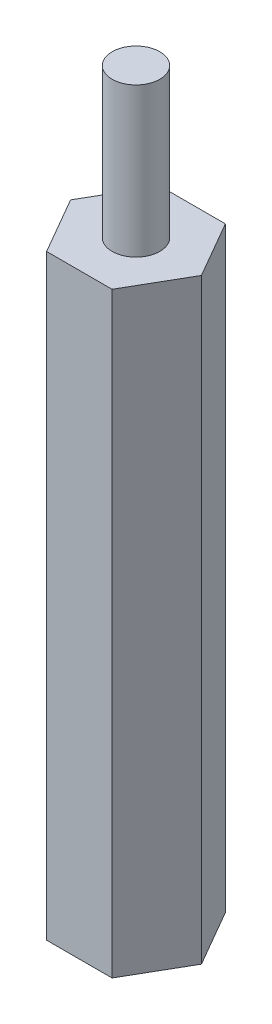
ISO-10303-21;
HEADER;
FILE_DESCRIPTION(('STEP AP214'),'2;1');
FILE_NAME('part.step','',(''),(''),'','','');
FILE_SCHEMA(('AUTOMOTIVE_DESIGN { 1 0 10303 214 1 1 1 1 }'));
ENDSEC;
DATA;
#1=APPLICATION_CONTEXT('core data for automotive mechanical design processes');
#2=APPLICATION_PROTOCOL_DEFINITION('international standard','automotive_design',2000,#1);
#3=PRODUCT_CONTEXT('',#1,'mechanical');
#4=PRODUCT('Part','Part','',(#3));
#5=PRODUCT_RELATED_PRODUCT_CATEGORY('part','',(#4));
#6=PRODUCT_DEFINITION_FORMATION('','',#4);
#7=PRODUCT_DEFINITION_CONTEXT('part definition',#1,'design');
#8=PRODUCT_DEFINITION('design','',#6,#7);
#9=PRODUCT_DEFINITION_SHAPE('','',#8);
#10=(LENGTH_UNIT() NAMED_UNIT(*) SI_UNIT(.MILLI.,.METRE.));
#11=(NAMED_UNIT(*) PLANE_ANGLE_UNIT() SI_UNIT($,.RADIAN.));
#12=(NAMED_UNIT(*) SI_UNIT($,.STERADIAN.) SOLID_ANGLE_UNIT());
#13=UNCERTAINTY_MEASURE_WITH_UNIT(LENGTH_MEASURE(1.E-05),#10,'distance_accuracy_value','');
#14=(GEOMETRIC_REPRESENTATION_CONTEXT(3) GLOBAL_UNCERTAINTY_ASSIGNED_CONTEXT((#13)) GLOBAL_UNIT_ASSIGNED_CONTEXT((#10,
#11,#12)) REPRESENTATION_CONTEXT('',''));
#15=CARTESIAN_POINT('',(0.,0.,0.));
#16=DIRECTION('',(0.,0.,1.));
#17=DIRECTION('',(1.,0.,0.));
#18=AXIS2_PLACEMENT_3D('',#15,#16,#17);
#19=CARTESIAN_POINT('',(-1.39314619955457,25.4,2.413));
#20=DIRECTION('',(0.,0.,-1.));
#21=DIRECTION('',(-1.,0.,0.));
#22=AXIS2_PLACEMENT_3D('',#19,#20,#21);
#23=PLANE('',#22);
#24=DIRECTION('',(1.,0.,0.));
#25=VECTOR('',#24,1.);
#26=CARTESIAN_POINT('',(-1.39314619955457,0.,2.413));
#27=LINE('',#26,#25);
#28=CARTESIAN_POINT('',(-1.39314619955457,0.,2.413));
#29=VERTEX_POINT('',#28);
#30=CARTESIAN_POINT('',(1.39314619955457,0.,2.413));
#31=VERTEX_POINT('',#30);
#32=EDGE_CURVE('E118',#29,#31,#27,.T.);
#33=ORIENTED_EDGE('',*,*,#32,.T.);
#34=DIRECTION('',(0.,-1.,0.));
#35=VECTOR('',#34,1.);
#36=CARTESIAN_POINT('',(1.39314619955457,25.4,2.413));
#37=LINE('',#36,#35);
#38=CARTESIAN_POINT('',(1.39314619955457,25.4,2.413));
#39=VERTEX_POINT('',#38);
#40=EDGE_CURVE('E35',#39,#31,#37,.T.);
#41=ORIENTED_EDGE('',*,*,#40,.F.);
#42=DIRECTION('',(1.,0.,0.));
#43=VECTOR('',#42,1.);
#44=CARTESIAN_POINT('',(-1.39314619955457,25.4,2.413));
#45=LINE('',#44,#43);
#46=CARTESIAN_POINT('',(-1.39314619955457,25.4,2.413));
#47=VERTEX_POINT('',#46);
#48=EDGE_CURVE('E129',#47,#39,#45,.T.);
#49=ORIENTED_EDGE('',*,*,#48,.F.);
#50=DIRECTION('',(0.,-1.,0.));
#51=VECTOR('',#50,1.);
#52=CARTESIAN_POINT('',(-1.39314619955457,25.4,2.413));
#53=LINE('',#52,#51);
#54=EDGE_CURVE('E114',#47,#29,#53,.T.);
#55=ORIENTED_EDGE('',*,*,#54,.T.);
#56=EDGE_LOOP('',(#33,#41,#49,#55));
#57=FACE_BOUND('',#56,.T.);
#58=ADVANCED_FACE('F32',(#57),#23,.F.);
#59=CARTESIAN_POINT('',(1.39314619955457,25.4,2.413));
#60=DIRECTION('',(-0.866025403784438,0.,-0.5));
#61=DIRECTION('',(-0.5,0.,0.866025403784439));
#62=AXIS2_PLACEMENT_3D('',#59,#60,#61);
#63=PLANE('',#62);
#64=DIRECTION('',(0.5,0.,-0.866025403784439));
#65=VECTOR('',#64,1.);
#66=CARTESIAN_POINT('',(1.39314619955457,0.,2.413));
#67=LINE('',#66,#65);
#68=CARTESIAN_POINT('',(2.78629239910913,0.,0.));
#69=VERTEX_POINT('',#68);
#70=EDGE_CURVE('E121',#31,#69,#67,.T.);
#71=ORIENTED_EDGE('',*,*,#70,.T.);
#72=DIRECTION('',(0.,-1.,0.));
#73=VECTOR('',#72,1.);
#74=CARTESIAN_POINT('',(2.78629239910913,25.4,0.));
#75=LINE('',#74,#73);
#76=CARTESIAN_POINT('',(2.78629239910913,25.4,0.));
#77=VERTEX_POINT('',#76);
#78=EDGE_CURVE('E132',#77,#69,#75,.T.);
#79=ORIENTED_EDGE('',*,*,#78,.F.);
#80=DIRECTION('',(0.5,0.,-0.866025403784439));
#81=VECTOR('',#80,1.);
#82=CARTESIAN_POINT('',(1.39314619955457,25.4,2.413));
#83=LINE('',#82,#81);
#84=EDGE_CURVE('E87',#39,#77,#83,.T.);
#85=ORIENTED_EDGE('',*,*,#84,.F.);
#86=ORIENTED_EDGE('',*,*,#40,.T.);
#87=EDGE_LOOP('',(#71,#79,#85,#86));
#88=FACE_BOUND('',#87,.T.);
#89=ADVANCED_FACE('F137',(#88),#63,.F.);
#90=CARTESIAN_POINT('',(2.78629239910913,25.4,0.));
#91=DIRECTION('',(-0.866025403784439,0.,0.5));
#92=DIRECTION('',(0.5,0.,0.866025403784439));
#93=AXIS2_PLACEMENT_3D('',#90,#91,#92);
#94=PLANE('',#93);
#95=DIRECTION('',(-0.5,0.,-0.866025403784439));
#96=VECTOR('',#95,1.);
#97=CARTESIAN_POINT('',(2.78629239910913,0.,0.));
#98=LINE('',#97,#96);
#99=CARTESIAN_POINT('',(1.39314619955457,0.,-2.413));
#100=VERTEX_POINT('',#99);
#101=EDGE_CURVE('E124',#69,#100,#98,.T.);
#102=ORIENTED_EDGE('',*,*,#101,.T.);
#103=DIRECTION('',(0.,-1.,0.));
#104=VECTOR('',#103,1.);
#105=CARTESIAN_POINT('',(1.39314619955457,25.4,-2.413));
#106=LINE('',#105,#104);
#107=CARTESIAN_POINT('',(1.39314619955457,25.4,-2.413));
#108=VERTEX_POINT('',#107);
#109=EDGE_CURVE('E109',#108,#100,#106,.T.);
#110=ORIENTED_EDGE('',*,*,#109,.F.);
#111=DIRECTION('',(-0.5,0.,-0.866025403784439));
#112=VECTOR('',#111,1.);
#113=CARTESIAN_POINT('',(2.78629239910913,25.4,0.));
#114=LINE('',#113,#112);
#115=EDGE_CURVE('E100',#77,#108,#114,.T.);
#116=ORIENTED_EDGE('',*,*,#115,.F.);
#117=ORIENTED_EDGE('',*,*,#78,.T.);
#118=EDGE_LOOP('',(#102,#110,#116,#117));
#119=FACE_BOUND('',#118,.T.);
#120=ADVANCED_FACE('F143',(#119),#94,.F.);
#121=CARTESIAN_POINT('',(1.39314619955457,25.4,-2.413));
#122=DIRECTION('',(0.,0.,1.));
#123=DIRECTION('',(1.,0.,0.));
#124=AXIS2_PLACEMENT_3D('',#121,#122,#123);
#125=PLANE('',#124);
#126=DIRECTION('',(-1.,0.,0.));
#127=VECTOR('',#126,1.);
#128=CARTESIAN_POINT('',(1.39314619955457,0.,-2.413));
#129=LINE('',#128,#127);
#130=CARTESIAN_POINT('',(-1.39314619955457,0.,-2.413));
#131=VERTEX_POINT('',#130);
#132=EDGE_CURVE('E108',#100,#131,#129,.T.);
#133=ORIENTED_EDGE('',*,*,#132,.T.);
#134=DIRECTION('',(0.,-1.,0.));
#135=VECTOR('',#134,1.);
#136=CARTESIAN_POINT('',(-1.39314619955457,25.4,-2.413));
#137=LINE('',#136,#135);
#138=CARTESIAN_POINT('',(-1.39314619955457,25.4,-2.413));
#139=VERTEX_POINT('',#138);
#140=EDGE_CURVE('E105',#139,#131,#137,.T.);
#141=ORIENTED_EDGE('',*,*,#140,.F.);
#142=DIRECTION('',(-1.,0.,0.));
#143=VECTOR('',#142,1.);
#144=CARTESIAN_POINT('',(1.39314619955457,25.4,-2.413));
#145=LINE('',#144,#143);
#146=EDGE_CURVE('E94',#108,#139,#145,.T.);
#147=ORIENTED_EDGE('',*,*,#146,.F.);
#148=ORIENTED_EDGE('',*,*,#109,.T.);
#149=EDGE_LOOP('',(#133,#141,#147,#148));
#150=FACE_BOUND('',#149,.T.);
#151=ADVANCED_FACE('F106',(#150),#125,.F.);
#152=CARTESIAN_POINT('',(-1.39314619955457,25.4,-2.413));
#153=DIRECTION('',(0.866025403784438,0.,0.5));
#154=DIRECTION('',(0.5,0.,-0.866025403784438));
#155=AXIS2_PLACEMENT_3D('',#152,#153,#154);
#156=PLANE('',#155);
#157=DIRECTION('',(-0.5,0.,0.866025403784438));
#158=VECTOR('',#157,1.);
#159=CARTESIAN_POINT('',(-1.39314619955457,0.,-2.413));
#160=LINE('',#159,#158);
#161=CARTESIAN_POINT('',(-2.78629239910913,0.,0.));
#162=VERTEX_POINT('',#161);
#163=EDGE_CURVE('E72',#131,#162,#160,.T.);
#164=ORIENTED_EDGE('',*,*,#163,.T.);
#165=DIRECTION('',(0.,-1.,0.));
#166=VECTOR('',#165,1.);
#167=CARTESIAN_POINT('',(-2.78629239910913,25.4,0.));
#168=LINE('',#167,#166);
#169=CARTESIAN_POINT('',(-2.78629239910913,25.4,0.));
#170=VERTEX_POINT('',#169);
#171=EDGE_CURVE('E110',#170,#162,#168,.T.);
#172=ORIENTED_EDGE('',*,*,#171,.F.);
#173=DIRECTION('',(-0.5,0.,0.866025403784438));
#174=VECTOR('',#173,1.);
#175=CARTESIAN_POINT('',(-1.39314619955457,25.4,-2.413));
#176=LINE('',#175,#174);
#177=EDGE_CURVE('E98',#139,#170,#176,.T.);
#178=ORIENTED_EDGE('',*,*,#177,.F.);
#179=ORIENTED_EDGE('',*,*,#140,.T.);
#180=EDGE_LOOP('',(#164,#172,#178,#179));
#181=FACE_BOUND('',#180,.T.);
#182=ADVANCED_FACE('F112',(#181),#156,.F.);
#183=CARTESIAN_POINT('',(-2.78629239910913,25.4,0.));
#184=DIRECTION('',(0.866025403784439,0.,-0.5));
#185=DIRECTION('',(-0.5,0.,-0.866025403784439));
#186=AXIS2_PLACEMENT_3D('',#183,#184,#185);
#187=PLANE('',#186);
#188=DIRECTION('',(0.5,0.,0.866025403784439));
#189=VECTOR('',#188,1.);
#190=CARTESIAN_POINT('',(-2.78629239910913,0.,0.));
#191=LINE('',#190,#189);
#192=EDGE_CURVE('E78',#162,#29,#191,.T.);
#193=ORIENTED_EDGE('',*,*,#192,.T.);
#194=ORIENTED_EDGE('',*,*,#54,.F.);
#195=DIRECTION('',(0.5,0.,0.866025403784439));
#196=VECTOR('',#195,1.);
#197=CARTESIAN_POINT('',(-2.78629239910913,25.4,0.));
#198=LINE('',#197,#196);
#199=EDGE_CURVE('E49',#170,#47,#198,.T.);
#200=ORIENTED_EDGE('',*,*,#199,.F.);
#201=ORIENTED_EDGE('',*,*,#171,.T.);
#202=EDGE_LOOP('',(#193,#194,#200,#201));
#203=FACE_BOUND('',#202,.T.);
#204=ADVANCED_FACE('F174',(#203),#187,.F.);
#205=CARTESIAN_POINT('',(0.,25.4,0.));
#206=DIRECTION('',(0.,1.,0.));
#207=DIRECTION('',(0.,0.,1.));
#208=AXIS2_PLACEMENT_3D('',#205,#206,#207);
#209=PLANE('',#208);
#210=CARTESIAN_POINT('',(0.,25.4,0.));
#211=DIRECTION('',(0.,1.,0.));
#212=DIRECTION('',(0.,0.,1.));
#213=AXIS2_PLACEMENT_3D('',#210,#211,#212);
#214=CIRCLE('',#213,1.016);
#215=CARTESIAN_POINT('',(0.,25.4,1.016));
#216=VERTEX_POINT('',#215);
#217=EDGE_CURVE('E11',#216,#216,#214,.T.);
#218=ORIENTED_EDGE('',*,*,#217,.F.);
#219=EDGE_LOOP('',(#218));
#220=FACE_BOUND('',#219,.T.);
#221=ORIENTED_EDGE('',*,*,#48,.T.);
#222=ORIENTED_EDGE('',*,*,#84,.T.);
#223=ORIENTED_EDGE('',*,*,#115,.T.);
#224=ORIENTED_EDGE('',*,*,#146,.T.);
#225=ORIENTED_EDGE('',*,*,#177,.T.);
#226=ORIENTED_EDGE('',*,*,#199,.T.);
#227=EDGE_LOOP('',(#221,#222,#223,#224,#225,#226));
#228=FACE_BOUND('',#227,.T.);
#229=ADVANCED_FACE('F96',(#220,#228),#209,.T.);
#230=CARTESIAN_POINT('',(0.,0.,0.));
#231=DIRECTION('',(0.,1.,0.));
#232=DIRECTION('',(0.,0.,1.));
#233=AXIS2_PLACEMENT_3D('',#230,#231,#232);
#234=PLANE('',#233);
#235=CARTESIAN_POINT('',(0.,0.,0.));
#236=DIRECTION('',(0.,-1.,0.));
#237=DIRECTION('',(0.,0.,-1.));
#238=AXIS2_PLACEMENT_3D('',#235,#236,#237);
#239=CIRCLE('',#238,1.016);
#240=CARTESIAN_POINT('',(0.,0.,-1.016));
#241=VERTEX_POINT('',#240);
#242=EDGE_CURVE('E150',#241,#241,#239,.T.);
#243=ORIENTED_EDGE('',*,*,#242,.F.);
#244=EDGE_LOOP('',(#243));
#245=FACE_BOUND('',#244,.T.);
#246=ORIENTED_EDGE('',*,*,#32,.F.);
#247=ORIENTED_EDGE('',*,*,#192,.F.);
#248=ORIENTED_EDGE('',*,*,#163,.F.);
#249=ORIENTED_EDGE('',*,*,#132,.F.);
#250=ORIENTED_EDGE('',*,*,#101,.F.);
#251=ORIENTED_EDGE('',*,*,#70,.F.);
#252=EDGE_LOOP('',(#246,#247,#248,#249,#250,#251));
#253=FACE_BOUND('',#252,.T.);
#254=ADVANCED_FACE('F142',(#245,#253),#234,.F.);
#255=CARTESIAN_POINT('',(0.,31.75,0.));
#256=DIRECTION('',(0.,-1.,0.));
#257=DIRECTION('',(0.,0.,-1.));
#258=AXIS2_PLACEMENT_3D('',#255,#256,#257);
#259=CYLINDRICAL_SURFACE('',#258,1.016);
#260=CARTESIAN_POINT('',(0.,31.75,0.));
#261=DIRECTION('',(0.,1.,0.));
#262=DIRECTION('',(0.,0.,1.));
#263=AXIS2_PLACEMENT_3D('',#260,#261,#262);
#264=CIRCLE('',#263,1.016);
#265=CARTESIAN_POINT('',(0.,31.75,1.016));
#266=VERTEX_POINT('',#265);
#267=EDGE_CURVE('E122',#266,#266,#264,.T.);
#268=ORIENTED_EDGE('',*,*,#267,.F.);
#269=EDGE_LOOP('',(#268));
#270=FACE_BOUND('',#269,.T.);
#271=ORIENTED_EDGE('',*,*,#217,.T.);
#272=EDGE_LOOP('',(#271));
#273=FACE_BOUND('',#272,.T.);
#274=ADVANCED_FACE('F166',(#270,#273),#259,.T.);
#275=CARTESIAN_POINT('',(0.,31.75,0.));
#276=DIRECTION('',(0.,1.,0.));
#277=DIRECTION('',(0.,0.,1.));
#278=AXIS2_PLACEMENT_3D('',#275,#276,#277);
#279=PLANE('',#278);
#280=ORIENTED_EDGE('',*,*,#267,.T.);
#281=EDGE_LOOP('',(#280));
#282=FACE_BOUND('',#281,.T.);
#283=ADVANCED_FACE('F161',(#282),#279,.T.);
#284=CARTESIAN_POINT('',(0.,6.35,0.));
#285=DIRECTION('',(0.,-1.,0.));
#286=DIRECTION('',(0.,0.,-1.));
#287=AXIS2_PLACEMENT_3D('',#284,#285,#286);
#288=CYLINDRICAL_SURFACE('',#287,1.016);
#289=CARTESIAN_POINT('',(0.,6.35,0.));
#290=DIRECTION('',(0.,-1.,0.));
#291=DIRECTION('',(0.,0.,-1.));
#292=AXIS2_PLACEMENT_3D('',#289,#290,#291);
#293=CIRCLE('',#292,1.016);
#294=CARTESIAN_POINT('',(0.,6.35,-1.016));
#295=VERTEX_POINT('',#294);
#296=EDGE_CURVE('E149',#295,#295,#293,.T.);
#297=ORIENTED_EDGE('',*,*,#296,.F.);
#298=EDGE_LOOP('',(#297));
#299=FACE_BOUND('',#298,.T.);
#300=ORIENTED_EDGE('',*,*,#242,.T.);
#301=EDGE_LOOP('',(#300));
#302=FACE_BOUND('',#301,.T.);
#303=ADVANCED_FACE('F158',(#299,#302),#288,.F.);
#304=CARTESIAN_POINT('',(0.,6.35,0.));
#305=DIRECTION('',(0.,-1.,0.));
#306=DIRECTION('',(0.,0.,-1.));
#307=AXIS2_PLACEMENT_3D('',#304,#305,#306);
#308=PLANE('',#307);
#309=ORIENTED_EDGE('',*,*,#296,.T.);
#310=EDGE_LOOP('',(#309));
#311=FACE_BOUND('',#310,.T.);
#312=ADVANCED_FACE('F156',(#311),#308,.T.);
#313=CLOSED_SHELL('',(#58,#89,#120,#151,#182,#204,#229,#254,#274,#283,#303,#312));
#314=MANIFOLD_SOLID_BREP('B2',#313);
#315=ADVANCED_BREP_SHAPE_REPRESENTATION('',(#18,#314),#14);
#316=SHAPE_DEFINITION_REPRESENTATION(#9,#315);
ENDSEC;
END-ISO-10303-21;
